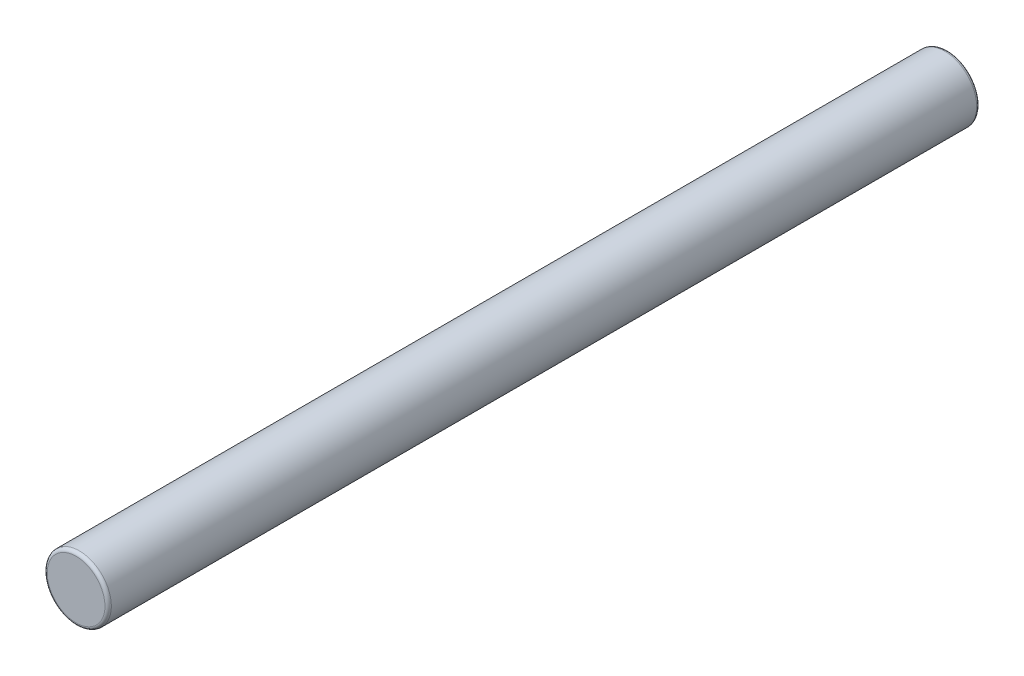
ISO-10303-21;
HEADER;
FILE_DESCRIPTION(('STEP AP214'),'2;1');
FILE_NAME('part.step','',(''),(''),'','','');
FILE_SCHEMA(('AUTOMOTIVE_DESIGN { 1 0 10303 214 1 1 1 1 }'));
ENDSEC;
DATA;
#1=APPLICATION_CONTEXT('core data for automotive mechanical design processes');
#2=APPLICATION_PROTOCOL_DEFINITION('international standard','automotive_design',2000,#1);
#3=PRODUCT_CONTEXT('',#1,'mechanical');
#4=PRODUCT('Part','Part','',(#3));
#5=PRODUCT_RELATED_PRODUCT_CATEGORY('part','',(#4));
#6=PRODUCT_DEFINITION_FORMATION('','',#4);
#7=PRODUCT_DEFINITION_CONTEXT('part definition',#1,'design');
#8=PRODUCT_DEFINITION('design','',#6,#7);
#9=PRODUCT_DEFINITION_SHAPE('','',#8);
#10=(LENGTH_UNIT() NAMED_UNIT(*) SI_UNIT(.MILLI.,.METRE.));
#11=(NAMED_UNIT(*) PLANE_ANGLE_UNIT() SI_UNIT($,.RADIAN.));
#12=(NAMED_UNIT(*) SI_UNIT($,.STERADIAN.) SOLID_ANGLE_UNIT());
#13=UNCERTAINTY_MEASURE_WITH_UNIT(LENGTH_MEASURE(1.E-05),#10,'distance_accuracy_value','');
#14=(GEOMETRIC_REPRESENTATION_CONTEXT(3) GLOBAL_UNCERTAINTY_ASSIGNED_CONTEXT((#13)) GLOBAL_UNIT_ASSIGNED_CONTEXT((#10,
#11,#12)) REPRESENTATION_CONTEXT('',''));
#15=CARTESIAN_POINT('',(0.,0.,0.));
#16=DIRECTION('',(0.,0.,1.));
#17=DIRECTION('',(1.,0.,0.));
#18=AXIS2_PLACEMENT_3D('',#15,#16,#17);
#19=CARTESIAN_POINT('',(0.,0.,68.));
#20=DIRECTION('',(0.,0.,-1.));
#21=DIRECTION('',(-1.,0.,0.));
#22=AXIS2_PLACEMENT_3D('',#19,#20,#21);
#23=CYLINDRICAL_SURFACE('',#22,2.5);
#24=CARTESIAN_POINT('',(0.,0.,67.75));
#25=DIRECTION('',(0.,0.,1.));
#26=DIRECTION('',(1.,0.,0.));
#27=AXIS2_PLACEMENT_3D('',#24,#25,#26);
#28=CIRCLE('',#27,2.5);
#29=CARTESIAN_POINT('',(2.5,0.,67.75));
#30=VERTEX_POINT('',#29);
#31=EDGE_CURVE('E37',#30,#30,#28,.F.);
#32=ORIENTED_EDGE('',*,*,#31,.T.);
#33=EDGE_LOOP('',(#32));
#34=FACE_BOUND('',#33,.T.);
#35=CARTESIAN_POINT('',(0.,0.,0.25));
#36=DIRECTION('',(0.,0.,1.));
#37=DIRECTION('',(1.,0.,0.));
#38=AXIS2_PLACEMENT_3D('',#35,#36,#37);
#39=CIRCLE('',#38,2.5);
#40=CARTESIAN_POINT('',(2.5,0.,0.25));
#41=VERTEX_POINT('',#40);
#42=EDGE_CURVE('E41',#41,#41,#39,.T.);
#43=ORIENTED_EDGE('',*,*,#42,.T.);
#44=EDGE_LOOP('',(#43));
#45=FACE_BOUND('',#44,.T.);
#46=ADVANCED_FACE('F30',(#34,#45),#23,.T.);
#47=CARTESIAN_POINT('',(0.,0.,68.));
#48=DIRECTION('',(0.,0.,1.));
#49=DIRECTION('',(1.,0.,0.));
#50=AXIS2_PLACEMENT_3D('',#47,#48,#49);
#51=PLANE('',#50);
#52=CARTESIAN_POINT('',(0.,0.,68.));
#53=DIRECTION('',(0.,0.,1.));
#54=DIRECTION('',(1.,0.,0.));
#55=AXIS2_PLACEMENT_3D('',#52,#53,#54);
#56=CIRCLE('',#55,2.25);
#57=CARTESIAN_POINT('',(2.25,0.,68.));
#58=VERTEX_POINT('',#57);
#59=EDGE_CURVE('E45',#58,#58,#56,.T.);
#60=ORIENTED_EDGE('',*,*,#59,.T.);
#61=EDGE_LOOP('',(#60));
#62=FACE_BOUND('',#61,.T.);
#63=ADVANCED_FACE('F51',(#62),#51,.T.);
#64=CARTESIAN_POINT('',(0.,0.,0.));
#65=DIRECTION('',(0.,0.,1.));
#66=DIRECTION('',(1.,0.,0.));
#67=AXIS2_PLACEMENT_3D('',#64,#65,#66);
#68=PLANE('',#67);
#69=CARTESIAN_POINT('',(0.,0.,0.));
#70=DIRECTION('',(0.,0.,1.));
#71=DIRECTION('',(1.,0.,0.));
#72=AXIS2_PLACEMENT_3D('',#69,#70,#71);
#73=CIRCLE('',#72,2.25);
#74=CARTESIAN_POINT('',(2.25,0.,0.));
#75=VERTEX_POINT('',#74);
#76=EDGE_CURVE('E10',#75,#75,#73,.F.);
#77=ORIENTED_EDGE('',*,*,#76,.T.);
#78=EDGE_LOOP('',(#77));
#79=FACE_BOUND('',#78,.T.);
#80=ADVANCED_FACE('F55',(#79),#68,.F.);
#81=CARTESIAN_POINT('',(0.,0.,67.75));
#82=DIRECTION('',(0.,0.,1.));
#83=DIRECTION('',(1.,0.,0.));
#84=AXIS2_PLACEMENT_3D('',#81,#82,#83);
#85=TOROIDAL_SURFACE('',#84,2.25,0.25);
#86=ORIENTED_EDGE('',*,*,#31,.F.);
#87=EDGE_LOOP('',(#86));
#88=FACE_BOUND('',#87,.T.);
#89=ORIENTED_EDGE('',*,*,#59,.F.);
#90=EDGE_LOOP('',(#89));
#91=FACE_BOUND('',#90,.T.);
#92=ADVANCED_FACE('F53',(#88,#91),#85,.T.);
#93=CARTESIAN_POINT('',(0.,0.,0.25));
#94=DIRECTION('',(0.,0.,1.));
#95=DIRECTION('',(1.,0.,0.));
#96=AXIS2_PLACEMENT_3D('',#93,#94,#95);
#97=TOROIDAL_SURFACE('',#96,2.25,0.25);
#98=ORIENTED_EDGE('',*,*,#76,.F.);
#99=EDGE_LOOP('',(#98));
#100=FACE_BOUND('',#99,.T.);
#101=ORIENTED_EDGE('',*,*,#42,.F.);
#102=EDGE_LOOP('',(#101));
#103=FACE_BOUND('',#102,.T.);
#104=ADVANCED_FACE('F32',(#100,#103),#97,.T.);
#105=CLOSED_SHELL('',(#46,#63,#80,#92,#104));
#106=MANIFOLD_SOLID_BREP('B2',#105);
#107=ADVANCED_BREP_SHAPE_REPRESENTATION('',(#18,#106),#14);
#108=SHAPE_DEFINITION_REPRESENTATION(#9,#107);
ENDSEC;
END-ISO-10303-21;
